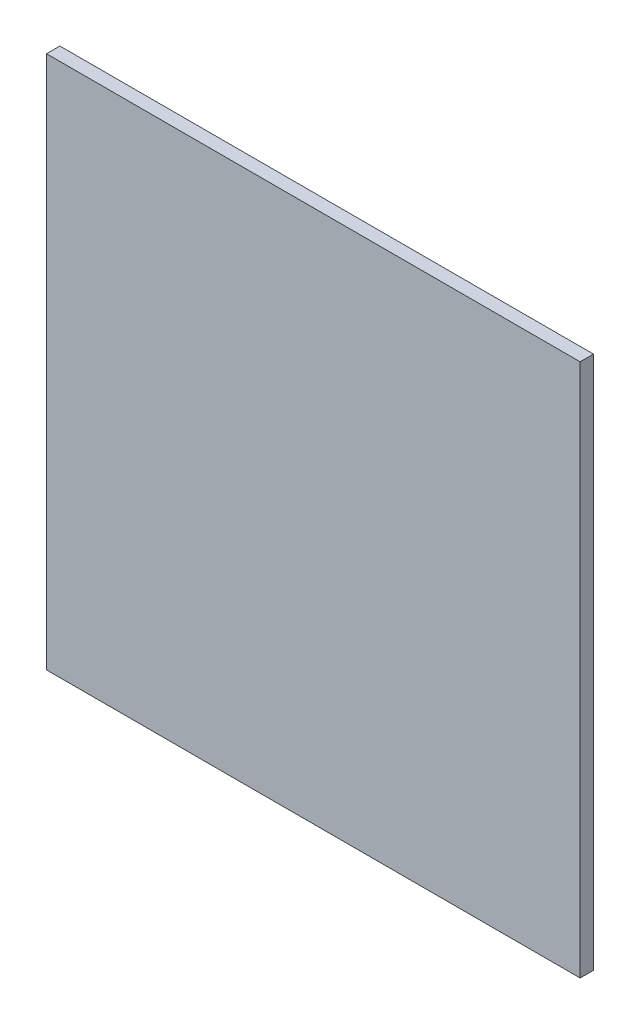
ISO-10303-21;
HEADER;
FILE_DESCRIPTION(('STEP AP214'),'2;1');
FILE_NAME('part.step','',(''),(''),'','','');
FILE_SCHEMA(('AUTOMOTIVE_DESIGN { 1 0 10303 214 1 1 1 1 }'));
ENDSEC;
DATA;
#1=APPLICATION_CONTEXT('core data for automotive mechanical design processes');
#2=APPLICATION_PROTOCOL_DEFINITION('international standard','automotive_design',2000,#1);
#3=PRODUCT_CONTEXT('',#1,'mechanical');
#4=PRODUCT('Part','Part','',(#3));
#5=PRODUCT_RELATED_PRODUCT_CATEGORY('part','',(#4));
#6=PRODUCT_DEFINITION_FORMATION('','',#4);
#7=PRODUCT_DEFINITION_CONTEXT('part definition',#1,'design');
#8=PRODUCT_DEFINITION('design','',#6,#7);
#9=PRODUCT_DEFINITION_SHAPE('','',#8);
#10=(LENGTH_UNIT() NAMED_UNIT(*) SI_UNIT(.MILLI.,.METRE.));
#11=(NAMED_UNIT(*) PLANE_ANGLE_UNIT() SI_UNIT($,.RADIAN.));
#12=(NAMED_UNIT(*) SI_UNIT($,.STERADIAN.) SOLID_ANGLE_UNIT());
#13=UNCERTAINTY_MEASURE_WITH_UNIT(LENGTH_MEASURE(1.E-05),#10,'distance_accuracy_value','');
#14=(GEOMETRIC_REPRESENTATION_CONTEXT(3) GLOBAL_UNCERTAINTY_ASSIGNED_CONTEXT((#13)) GLOBAL_UNIT_ASSIGNED_CONTEXT((#10,
#11,#12)) REPRESENTATION_CONTEXT('',''));
#15=CARTESIAN_POINT('',(0.,0.,0.));
#16=DIRECTION('',(0.,0.,1.));
#17=DIRECTION('',(1.,0.,0.));
#18=AXIS2_PLACEMENT_3D('',#15,#16,#17);
#19=CARTESIAN_POINT('',(-9.864,-4.6,-6.999));
#20=DIRECTION('',(0.,-1.,0.));
#21=DIRECTION('',(-1.,0.,0.));
#22=AXIS2_PLACEMENT_3D('',#19,#20,#21);
#23=PLANE('',#22);
#24=DIRECTION('',(0.,0.,1.));
#25=VECTOR('',#24,1.);
#26=CARTESIAN_POINT('',(-10.665,-4.6,-7.01));
#27=LINE('',#26,#25);
#28=CARTESIAN_POINT('',(-10.665,-4.6,-7.02));
#29=VERTEX_POINT('',#28);
#30=CARTESIAN_POINT('',(-10.665,-4.6,-7.));
#31=VERTEX_POINT('',#30);
#32=EDGE_CURVE('E21',#29,#31,#27,.T.);
#33=ORIENTED_EDGE('',*,*,#32,.F.);
#34=DIRECTION('',(-1.,0.,0.));
#35=VECTOR('',#34,1.);
#36=CARTESIAN_POINT('',(-10.265,-4.6,-7.02));
#37=LINE('',#36,#35);
#38=CARTESIAN_POINT('',(-9.865,-4.6,-7.02));
#39=VERTEX_POINT('',#38);
#40=EDGE_CURVE('E81',#39,#29,#37,.T.);
#41=ORIENTED_EDGE('',*,*,#40,.F.);
#42=DIRECTION('',(0.,0.,-1.));
#43=VECTOR('',#42,1.);
#44=CARTESIAN_POINT('',(-9.865,-4.6,-7.01));
#45=LINE('',#44,#43);
#46=CARTESIAN_POINT('',(-9.865,-4.6,-7.));
#47=VERTEX_POINT('',#46);
#48=EDGE_CURVE('E69',#47,#39,#45,.T.);
#49=ORIENTED_EDGE('',*,*,#48,.F.);
#50=DIRECTION('',(1.,0.,0.));
#51=VECTOR('',#50,1.);
#52=CARTESIAN_POINT('',(-10.265,-4.6,-7.));
#53=LINE('',#52,#51);
#54=EDGE_CURVE('E56',#31,#47,#53,.T.);
#55=ORIENTED_EDGE('',*,*,#54,.F.);
#56=EDGE_LOOP('',(#33,#41,#49,#55));
#57=FACE_BOUND('',#56,.T.);
#58=ADVANCED_FACE('F17',(#57),#23,.T.);
#59=CARTESIAN_POINT('',(-10.665,-4.601,-6.999));
#60=DIRECTION('',(-1.,0.,0.));
#61=DIRECTION('',(0.,1.,0.));
#62=AXIS2_PLACEMENT_3D('',#59,#60,#61);
#63=PLANE('',#62);
#64=DIRECTION('',(0.,0.,1.));
#65=VECTOR('',#64,1.);
#66=CARTESIAN_POINT('',(-10.665,-3.8,-7.01));
#67=LINE('',#66,#65);
#68=CARTESIAN_POINT('',(-10.665,-3.8,-7.02));
#69=VERTEX_POINT('',#68);
#70=CARTESIAN_POINT('',(-10.665,-3.8,-7.));
#71=VERTEX_POINT('',#70);
#72=EDGE_CURVE('E84',#69,#71,#67,.T.);
#73=ORIENTED_EDGE('',*,*,#72,.F.);
#74=DIRECTION('',(0.,1.,0.));
#75=VECTOR('',#74,1.);
#76=CARTESIAN_POINT('',(-10.665,-4.2,-7.02));
#77=LINE('',#76,#75);
#78=EDGE_CURVE('E65',#29,#69,#77,.T.);
#79=ORIENTED_EDGE('',*,*,#78,.F.);
#80=ORIENTED_EDGE('',*,*,#32,.T.);
#81=DIRECTION('',(0.,-1.,0.));
#82=VECTOR('',#81,1.);
#83=CARTESIAN_POINT('',(-10.665,-4.2,-7.));
#84=LINE('',#83,#82);
#85=EDGE_CURVE('E62',#71,#31,#84,.T.);
#86=ORIENTED_EDGE('',*,*,#85,.F.);
#87=EDGE_LOOP('',(#73,#79,#80,#86));
#88=FACE_BOUND('',#87,.T.);
#89=ADVANCED_FACE('F61',(#88),#63,.T.);
#90=CARTESIAN_POINT('',(-9.864,-3.799,-7.));
#91=DIRECTION('',(0.,0.,1.));
#92=DIRECTION('',(-1.,0.,0.));
#93=AXIS2_PLACEMENT_3D('',#90,#91,#92);
#94=PLANE('',#93);
#95=DIRECTION('',(0.,-1.,0.));
#96=VECTOR('',#95,1.);
#97=CARTESIAN_POINT('',(-9.865,-4.2,-7.));
#98=LINE('',#97,#96);
#99=CARTESIAN_POINT('',(-9.865,-3.8,-7.));
#100=VERTEX_POINT('',#99);
#101=EDGE_CURVE('E71',#100,#47,#98,.T.);
#102=ORIENTED_EDGE('',*,*,#101,.F.);
#103=DIRECTION('',(1.,0.,0.));
#104=VECTOR('',#103,1.);
#105=CARTESIAN_POINT('',(-10.265,-3.8,-7.));
#106=LINE('',#105,#104);
#107=EDGE_CURVE('E75',#71,#100,#106,.T.);
#108=ORIENTED_EDGE('',*,*,#107,.F.);
#109=ORIENTED_EDGE('',*,*,#85,.T.);
#110=ORIENTED_EDGE('',*,*,#54,.T.);
#111=EDGE_LOOP('',(#102,#108,#109,#110));
#112=FACE_BOUND('',#111,.T.);
#113=ADVANCED_FACE('F73',(#112),#94,.T.);
#114=CARTESIAN_POINT('',(-9.865,-3.799,-6.999));
#115=DIRECTION('',(1.,0.,0.));
#116=DIRECTION('',(0.,-1.,0.));
#117=AXIS2_PLACEMENT_3D('',#114,#115,#116);
#118=PLANE('',#117);
#119=ORIENTED_EDGE('',*,*,#48,.T.);
#120=DIRECTION('',(0.,-1.,0.));
#121=VECTOR('',#120,1.);
#122=CARTESIAN_POINT('',(-9.865,-4.2,-7.02));
#123=LINE('',#122,#121);
#124=CARTESIAN_POINT('',(-9.865,-3.8,-7.02));
#125=VERTEX_POINT('',#124);
#126=EDGE_CURVE('E36',#125,#39,#123,.T.);
#127=ORIENTED_EDGE('',*,*,#126,.F.);
#128=DIRECTION('',(0.,0.,-1.));
#129=VECTOR('',#128,1.);
#130=CARTESIAN_POINT('',(-9.865,-3.8,-7.01));
#131=LINE('',#130,#129);
#132=EDGE_CURVE('E27',#100,#125,#131,.T.);
#133=ORIENTED_EDGE('',*,*,#132,.F.);
#134=ORIENTED_EDGE('',*,*,#101,.T.);
#135=EDGE_LOOP('',(#119,#127,#133,#134));
#136=FACE_BOUND('',#135,.T.);
#137=ADVANCED_FACE('F89',(#136),#118,.T.);
#138=CARTESIAN_POINT('',(-10.666,-3.799,-7.02));
#139=DIRECTION('',(0.,0.,-1.));
#140=DIRECTION('',(1.,0.,0.));
#141=AXIS2_PLACEMENT_3D('',#138,#139,#140);
#142=PLANE('',#141);
#143=ORIENTED_EDGE('',*,*,#40,.T.);
#144=ORIENTED_EDGE('',*,*,#78,.T.);
#145=DIRECTION('',(-1.,0.,0.));
#146=VECTOR('',#145,1.);
#147=CARTESIAN_POINT('',(-10.265,-3.8,-7.02));
#148=LINE('',#147,#146);
#149=EDGE_CURVE('E11',#125,#69,#148,.T.);
#150=ORIENTED_EDGE('',*,*,#149,.F.);
#151=ORIENTED_EDGE('',*,*,#126,.T.);
#152=EDGE_LOOP('',(#143,#144,#150,#151));
#153=FACE_BOUND('',#152,.T.);
#154=ADVANCED_FACE('F91',(#153),#142,.T.);
#155=CARTESIAN_POINT('',(-10.666,-3.8,-6.999));
#156=DIRECTION('',(0.,1.,0.));
#157=DIRECTION('',(1.,0.,0.));
#158=AXIS2_PLACEMENT_3D('',#155,#156,#157);
#159=PLANE('',#158);
#160=ORIENTED_EDGE('',*,*,#132,.T.);
#161=ORIENTED_EDGE('',*,*,#149,.T.);
#162=ORIENTED_EDGE('',*,*,#72,.T.);
#163=ORIENTED_EDGE('',*,*,#107,.T.);
#164=EDGE_LOOP('',(#160,#161,#162,#163));
#165=FACE_BOUND('',#164,.T.);
#166=ADVANCED_FACE('F19',(#165),#159,.T.);
#167=CLOSED_SHELL('',(#58,#89,#113,#137,#154,#166));
#168=MANIFOLD_SOLID_BREP('B1',#167);
#169=ADVANCED_BREP_SHAPE_REPRESENTATION('',(#18,#168),#14);
#170=SHAPE_DEFINITION_REPRESENTATION(#9,#169);
ENDSEC;
END-ISO-10303-21;
